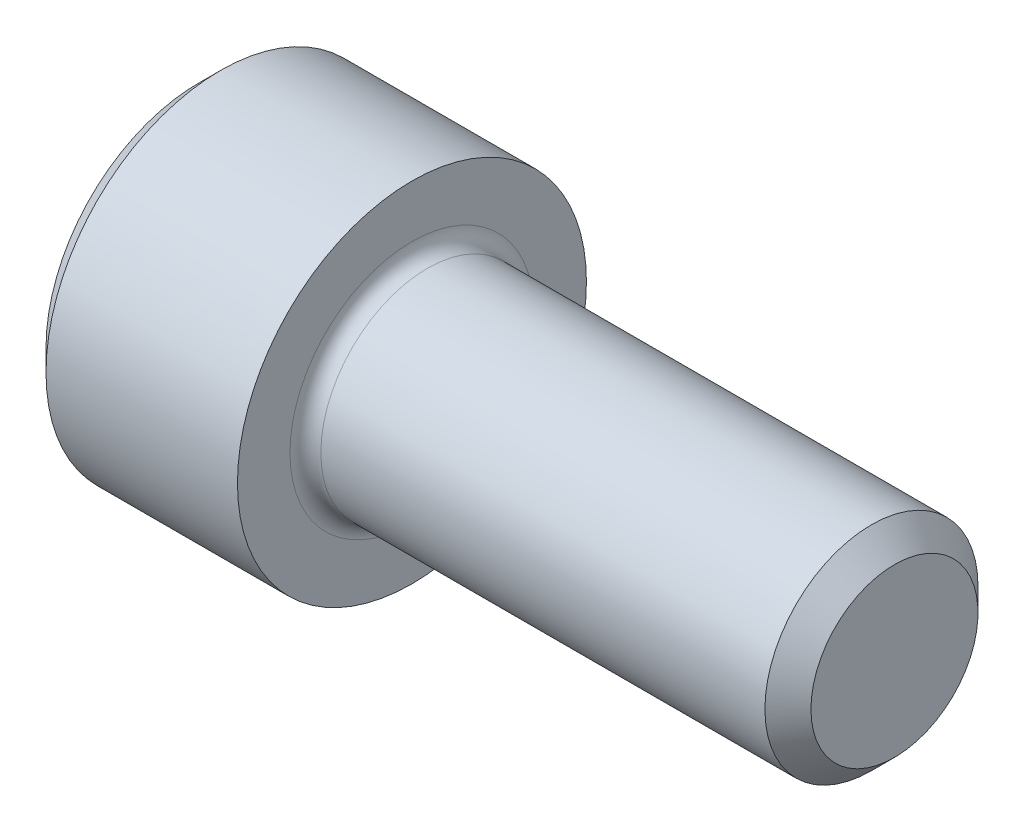
ISO-10303-21;
HEADER;
FILE_DESCRIPTION(('STEP AP214'),'2;1');
FILE_NAME('part.step','',(''),(''),'','','');
FILE_SCHEMA(('AUTOMOTIVE_DESIGN { 1 0 10303 214 1 1 1 1 }'));
ENDSEC;
DATA;
#1=APPLICATION_CONTEXT('core data for automotive mechanical design processes');
#2=APPLICATION_PROTOCOL_DEFINITION('international standard','automotive_design',2000,#1);
#3=PRODUCT_CONTEXT('',#1,'mechanical');
#4=PRODUCT('Part','Part','',(#3));
#5=PRODUCT_RELATED_PRODUCT_CATEGORY('part','',(#4));
#6=PRODUCT_DEFINITION_FORMATION('','',#4);
#7=PRODUCT_DEFINITION_CONTEXT('part definition',#1,'design');
#8=PRODUCT_DEFINITION('design','',#6,#7);
#9=PRODUCT_DEFINITION_SHAPE('','',#8);
#10=(LENGTH_UNIT() NAMED_UNIT(*) SI_UNIT(.MILLI.,.METRE.));
#11=(NAMED_UNIT(*) PLANE_ANGLE_UNIT() SI_UNIT($,.RADIAN.));
#12=(NAMED_UNIT(*) SI_UNIT($,.STERADIAN.) SOLID_ANGLE_UNIT());
#13=UNCERTAINTY_MEASURE_WITH_UNIT(LENGTH_MEASURE(1.E-05),#10,'distance_accuracy_value','');
#14=(GEOMETRIC_REPRESENTATION_CONTEXT(3) GLOBAL_UNCERTAINTY_ASSIGNED_CONTEXT((#13)) GLOBAL_UNIT_ASSIGNED_CONTEXT((#10,
#11,#12)) REPRESENTATION_CONTEXT('',''));
#15=CARTESIAN_POINT('',(0.,0.,0.));
#16=DIRECTION('',(0.,0.,1.));
#17=DIRECTION('',(1.,0.,0.));
#18=AXIS2_PLACEMENT_3D('',#15,#16,#17);
#19=CARTESIAN_POINT('',(0.,0.,0.));
#20=DIRECTION('',(-1.,0.,0.));
#21=DIRECTION('',(0.,0.,1.));
#22=AXIS2_PLACEMENT_3D('',#19,#20,#21);
#23=PLANE('',#22);
#24=DIRECTION('',(0.,-0.499999999999998,0.86602540378444));
#25=VECTOR('',#24,1.);
#26=CARTESIAN_POINT('',(0.,1.5984519552784,0.));
#27=LINE('',#26,#25);
#28=CARTESIAN_POINT('',(0.,1.5984519552784,0.));
#29=VERTEX_POINT('',#28);
#30=CARTESIAN_POINT('',(0.,0.799225977639206,1.3843));
#31=VERTEX_POINT('',#30);
#32=EDGE_CURVE('E262',#29,#31,#27,.T.);
#33=ORIENTED_EDGE('',*,*,#32,.T.);
#34=DIRECTION('',(0.,1.,0.));
#35=VECTOR('',#34,1.);
#36=CARTESIAN_POINT('',(0.,-0.799225977639191,1.3843));
#37=LINE('',#36,#35);
#38=CARTESIAN_POINT('',(0.,-0.799225977639191,1.3843));
#39=VERTEX_POINT('',#38);
#40=EDGE_CURVE('E133',#39,#31,#37,.T.);
#41=ORIENTED_EDGE('',*,*,#40,.F.);
#42=DIRECTION('',(0.,-0.500000000000001,-0.866025403784438));
#43=VECTOR('',#42,1.);
#44=CARTESIAN_POINT('',(0.,-0.799225977639191,1.3843));
#45=LINE('',#44,#43);
#46=CARTESIAN_POINT('',(0.,-1.59845195527839,0.));
#47=VERTEX_POINT('',#46);
#48=EDGE_CURVE('E265',#39,#47,#45,.T.);
#49=ORIENTED_EDGE('',*,*,#48,.T.);
#50=DIRECTION('',(0.,0.499999999999998,-0.86602540378444));
#51=VECTOR('',#50,1.);
#52=CARTESIAN_POINT('',(0.,-1.59845195527839,0.));
#53=LINE('',#52,#51);
#54=CARTESIAN_POINT('',(0.,-0.799225977639196,-1.3843));
#55=VERTEX_POINT('',#54);
#56=EDGE_CURVE('E268',#47,#55,#53,.T.);
#57=ORIENTED_EDGE('',*,*,#56,.T.);
#58=DIRECTION('',(0.,-1.,0.));
#59=VECTOR('',#58,1.);
#60=CARTESIAN_POINT('',(0.,0.799225977639201,-1.3843));
#61=LINE('',#60,#59);
#62=CARTESIAN_POINT('',(0.,0.799225977639201,-1.3843));
#63=VERTEX_POINT('',#62);
#64=EDGE_CURVE('E271',#63,#55,#61,.T.);
#65=ORIENTED_EDGE('',*,*,#64,.F.);
#66=DIRECTION('',(0.,-0.500000000000001,-0.866025403784438));
#67=VECTOR('',#66,1.);
#68=CARTESIAN_POINT('',(0.,1.5984519552784,0.));
#69=LINE('',#68,#67);
#70=EDGE_CURVE('E128',#29,#63,#69,.T.);
#71=ORIENTED_EDGE('',*,*,#70,.F.);
#72=EDGE_LOOP('',(#33,#41,#49,#57,#65,#71));
#73=FACE_BOUND('',#72,.T.);
#74=CARTESIAN_POINT('',(0.,0.,0.));
#75=DIRECTION('',(-1.,0.,0.));
#76=DIRECTION('',(0.,0.,1.));
#77=AXIS2_PLACEMENT_3D('',#74,#75,#76);
#78=CIRCLE('',#77,2.5146);
#79=CARTESIAN_POINT('',(0.,0.,2.5146));
#80=VERTEX_POINT('',#79);
#81=EDGE_CURVE('E157',#80,#80,#78,.T.);
#82=ORIENTED_EDGE('',*,*,#81,.T.);
#83=EDGE_LOOP('',(#82));
#84=FACE_BOUND('',#83,.T.);
#85=ADVANCED_FACE('F37',(#73,#84),#23,.T.);
#86=CARTESIAN_POINT('',(0.,0.,0.));
#87=DIRECTION('',(1.,0.,0.));
#88=DIRECTION('',(0.,0.,-1.));
#89=AXIS2_PLACEMENT_3D('',#86,#87,#88);
#90=CONICAL_SURFACE('',#89,2.5146,0.785398163397456);
#91=CARTESIAN_POINT('',(0.355599999999998,0.,0.));
#92=DIRECTION('',(-1.,0.,0.));
#93=DIRECTION('',(0.,0.,1.));
#94=AXIS2_PLACEMENT_3D('',#91,#92,#93);
#95=CIRCLE('',#94,2.8702);
#96=CARTESIAN_POINT('',(0.355599999999998,0.,2.8702));
#97=VERTEX_POINT('',#96);
#98=EDGE_CURVE('E154',#97,#97,#95,.T.);
#99=ORIENTED_EDGE('',*,*,#98,.T.);
#100=EDGE_LOOP('',(#99));
#101=FACE_BOUND('',#100,.T.);
#102=ORIENTED_EDGE('',*,*,#81,.F.);
#103=EDGE_LOOP('',(#102));
#104=FACE_BOUND('',#103,.T.);
#105=ADVANCED_FACE('F178',(#101,#104),#90,.T.);
#106=CARTESIAN_POINT('',(-31.75,0.,0.));
#107=DIRECTION('',(-1.,0.,0.));
#108=DIRECTION('',(0.,0.,1.));
#109=AXIS2_PLACEMENT_3D('',#106,#107,#108);
#110=CYLINDRICAL_SURFACE('',#109,2.8702);
#111=CARTESIAN_POINT('',(3.5052,0.,0.));
#112=DIRECTION('',(-1.,0.,0.));
#113=DIRECTION('',(0.,0.,1.));
#114=AXIS2_PLACEMENT_3D('',#111,#112,#113);
#115=CIRCLE('',#114,2.8702);
#116=CARTESIAN_POINT('',(3.5052,0.,2.8702));
#117=VERTEX_POINT('',#116);
#118=EDGE_CURVE('E151',#117,#117,#115,.T.);
#119=ORIENTED_EDGE('',*,*,#118,.T.);
#120=EDGE_LOOP('',(#119));
#121=FACE_BOUND('',#120,.T.);
#122=ORIENTED_EDGE('',*,*,#98,.F.);
#123=EDGE_LOOP('',(#122));
#124=FACE_BOUND('',#123,.T.);
#125=ADVANCED_FACE('F183',(#121,#124),#110,.T.);
#126=CARTESIAN_POINT('',(3.5052,2.8702,0.));
#127=DIRECTION('',(1.,0.,0.));
#128=DIRECTION('',(0.,0.,-1.));
#129=AXIS2_PLACEMENT_3D('',#126,#127,#128);
#130=PLANE('',#129);
#131=CARTESIAN_POINT('',(3.5052,0.,0.));
#132=DIRECTION('',(1.,0.,0.));
#133=DIRECTION('',(0.,0.,-1.));
#134=AXIS2_PLACEMENT_3D('',#131,#132,#133);
#135=CIRCLE('',#134,2.0066);
#136=CARTESIAN_POINT('',(3.5052,0.,-2.0066));
#137=VERTEX_POINT('',#136);
#138=EDGE_CURVE('E45',#137,#137,#135,.F.);
#139=ORIENTED_EDGE('',*,*,#138,.T.);
#140=EDGE_LOOP('',(#139));
#141=FACE_BOUND('',#140,.T.);
#142=ORIENTED_EDGE('',*,*,#118,.F.);
#143=EDGE_LOOP('',(#142));
#144=FACE_BOUND('',#143,.T.);
#145=ADVANCED_FACE('F162',(#141,#144),#130,.T.);
#146=CARTESIAN_POINT('',(-31.75,0.,0.));
#147=DIRECTION('',(-1.,0.,0.));
#148=DIRECTION('',(0.,0.,1.));
#149=AXIS2_PLACEMENT_3D('',#146,#147,#148);
#150=CYLINDRICAL_SURFACE('',#149,1.7526);
#151=CARTESIAN_POINT('',(3.7592,0.,0.));
#152=DIRECTION('',(1.,0.,0.));
#153=DIRECTION('',(0.,0.,-1.));
#154=AXIS2_PLACEMENT_3D('',#151,#152,#153);
#155=CIRCLE('',#154,1.7526);
#156=CARTESIAN_POINT('',(3.7592,0.,-1.7526));
#157=VERTEX_POINT('',#156);
#158=EDGE_CURVE('E11',#157,#157,#155,.T.);
#159=ORIENTED_EDGE('',*,*,#158,.T.);
#160=EDGE_LOOP('',(#159));
#161=FACE_BOUND('',#160,.T.);
#162=CARTESIAN_POINT('',(11.06424,0.,0.));
#163=DIRECTION('',(-1.,0.,0.));
#164=DIRECTION('',(0.,0.,1.));
#165=AXIS2_PLACEMENT_3D('',#162,#163,#164);
#166=CIRCLE('',#165,1.7526);
#167=CARTESIAN_POINT('',(11.06424,0.,1.7526));
#168=VERTEX_POINT('',#167);
#169=EDGE_CURVE('E148',#168,#168,#166,.T.);
#170=ORIENTED_EDGE('',*,*,#169,.T.);
#171=EDGE_LOOP('',(#170));
#172=FACE_BOUND('',#171,.T.);
#173=ADVANCED_FACE('F193',(#161,#172),#150,.T.);
#174=CARTESIAN_POINT('',(11.4427,0.,0.));
#175=DIRECTION('',(-1.,0.,0.));
#176=DIRECTION('',(0.,0.,1.));
#177=AXIS2_PLACEMENT_3D('',#174,#175,#176);
#178=CONICAL_SURFACE('',#177,1.37414,0.785398163397451);
#179=ORIENTED_EDGE('',*,*,#169,.F.);
#180=EDGE_LOOP('',(#179));
#181=FACE_BOUND('',#180,.T.);
#182=CARTESIAN_POINT('',(11.4427,0.,0.));
#183=DIRECTION('',(-1.,0.,0.));
#184=DIRECTION('',(0.,0.,1.));
#185=AXIS2_PLACEMENT_3D('',#182,#183,#184);
#186=CIRCLE('',#185,1.37414);
#187=CARTESIAN_POINT('',(11.4427,0.,1.37414));
#188=VERTEX_POINT('',#187);
#189=EDGE_CURVE('E144',#188,#188,#186,.T.);
#190=ORIENTED_EDGE('',*,*,#189,.T.);
#191=EDGE_LOOP('',(#190));
#192=FACE_BOUND('',#191,.T.);
#193=ADVANCED_FACE('F173',(#181,#192),#178,.T.);
#194=CARTESIAN_POINT('',(11.4427,1.37414,0.));
#195=DIRECTION('',(1.,0.,0.));
#196=DIRECTION('',(0.,0.,-1.));
#197=AXIS2_PLACEMENT_3D('',#194,#195,#196);
#198=PLANE('',#197);
#199=ORIENTED_EDGE('',*,*,#189,.F.);
#200=EDGE_LOOP('',(#199));
#201=FACE_BOUND('',#200,.T.);
#202=ADVANCED_FACE('F166',(#201),#198,.T.);
#203=CARTESIAN_POINT('',(3.7592,0.,0.));
#204=DIRECTION('',(1.,0.,0.));
#205=DIRECTION('',(0.,0.,-1.));
#206=AXIS2_PLACEMENT_3D('',#203,#204,#205);
#207=TOROIDAL_SURFACE('',#206,2.0066,0.254);
#208=ORIENTED_EDGE('',*,*,#158,.F.);
#209=EDGE_LOOP('',(#208));
#210=FACE_BOUND('',#209,.T.);
#211=ORIENTED_EDGE('',*,*,#138,.F.);
#212=EDGE_LOOP('',(#211));
#213=FACE_BOUND('',#212,.T.);
#214=ADVANCED_FACE('F39',(#210,#213),#207,.F.);
#215=CARTESIAN_POINT('',(1.6256,1.5984519552784,0.));
#216=DIRECTION('',(0.,-0.86602540378444,-0.499999999999998));
#217=DIRECTION('',(0.,0.499999999999998,-0.86602540378444));
#218=AXIS2_PLACEMENT_3D('',#215,#216,#217);
#219=PLANE('',#218);
#220=ORIENTED_EDGE('',*,*,#32,.F.);
#221=DIRECTION('',(-1.,0.,0.));
#222=VECTOR('',#221,1.);
#223=CARTESIAN_POINT('',(1.6256,1.5984519552784,0.));
#224=LINE('',#223,#222);
#225=CARTESIAN_POINT('',(1.6256,1.5984519552784,0.));
#226=VERTEX_POINT('',#225);
#227=EDGE_CURVE('E252',#226,#29,#224,.T.);
#228=ORIENTED_EDGE('',*,*,#227,.F.);
#229=DIRECTION('',(0.,-0.499999999999998,0.86602540378444));
#230=VECTOR('',#229,1.);
#231=CARTESIAN_POINT('',(1.6256,1.5984519552784,0.));
#232=LINE('',#231,#230);
#233=CARTESIAN_POINT('',(1.6256,1.1988389664588,0.692149999999999));
#234=VERTEX_POINT('',#233);
#235=EDGE_CURVE('E120',#226,#234,#232,.T.);
#236=ORIENTED_EDGE('',*,*,#235,.T.);
#237=CARTESIAN_POINT('',(1.6256,0.799225977639206,1.3843));
#238=VERTEX_POINT('',#237);
#239=EDGE_CURVE('E111',#234,#238,#232,.T.);
#240=ORIENTED_EDGE('',*,*,#239,.T.);
#241=DIRECTION('',(-1.,0.,0.));
#242=VECTOR('',#241,1.);
#243=CARTESIAN_POINT('',(1.6256,0.799225977639206,1.3843));
#244=LINE('',#243,#242);
#245=EDGE_CURVE('E125',#238,#31,#244,.T.);
#246=ORIENTED_EDGE('',*,*,#245,.T.);
#247=EDGE_LOOP('',(#220,#228,#236,#240,#246));
#248=FACE_BOUND('',#247,.T.);
#249=ADVANCED_FACE('F124',(#248),#219,.T.);
#250=CARTESIAN_POINT('',(1.6256,-0.799225977639191,1.3843));
#251=DIRECTION('',(0.,0.,1.));
#252=DIRECTION('',(0.,-1.,0.));
#253=AXIS2_PLACEMENT_3D('',#250,#251,#252);
#254=PLANE('',#253);
#255=ORIENTED_EDGE('',*,*,#40,.T.);
#256=ORIENTED_EDGE('',*,*,#245,.F.);
#257=DIRECTION('',(0.,1.,0.));
#258=VECTOR('',#257,1.);
#259=CARTESIAN_POINT('',(1.6256,-0.799225977639191,1.3843));
#260=LINE('',#259,#258);
#261=CARTESIAN_POINT('',(1.6256,0.,1.3843));
#262=VERTEX_POINT('',#261);
#263=EDGE_CURVE('E108',#262,#238,#260,.T.);
#264=ORIENTED_EDGE('',*,*,#263,.F.);
#265=CARTESIAN_POINT('',(1.6256,-0.799225977639191,1.3843));
#266=VERTEX_POINT('',#265);
#267=EDGE_CURVE('E119',#266,#262,#260,.T.);
#268=ORIENTED_EDGE('',*,*,#267,.F.);
#269=DIRECTION('',(-1.,0.,0.));
#270=VECTOR('',#269,1.);
#271=CARTESIAN_POINT('',(1.6256,-0.799225977639191,1.3843));
#272=LINE('',#271,#270);
#273=EDGE_CURVE('E135',#266,#39,#272,.T.);
#274=ORIENTED_EDGE('',*,*,#273,.T.);
#275=EDGE_LOOP('',(#255,#256,#264,#268,#274));
#276=FACE_BOUND('',#275,.T.);
#277=ADVANCED_FACE('F130',(#276),#254,.F.);
#278=CARTESIAN_POINT('',(1.6256,-0.799225977639191,1.3843));
#279=DIRECTION('',(0.,0.866025403784438,-0.500000000000001));
#280=DIRECTION('',(0.,0.500000000000001,0.866025403784438));
#281=AXIS2_PLACEMENT_3D('',#278,#279,#280);
#282=PLANE('',#281);
#283=ORIENTED_EDGE('',*,*,#48,.F.);
#284=ORIENTED_EDGE('',*,*,#273,.F.);
#285=DIRECTION('',(0.,-0.500000000000001,-0.866025403784438));
#286=VECTOR('',#285,1.);
#287=CARTESIAN_POINT('',(1.6256,-0.799225977639191,1.3843));
#288=LINE('',#287,#286);
#289=CARTESIAN_POINT('',(1.6256,-1.19883896645879,0.692149999999998));
#290=VERTEX_POINT('',#289);
#291=EDGE_CURVE('E291',#266,#290,#288,.T.);
#292=ORIENTED_EDGE('',*,*,#291,.T.);
#293=CARTESIAN_POINT('',(1.6256,-1.59845195527839,0.));
#294=VERTEX_POINT('',#293);
#295=EDGE_CURVE('E280',#290,#294,#288,.T.);
#296=ORIENTED_EDGE('',*,*,#295,.T.);
#297=DIRECTION('',(-1.,0.,0.));
#298=VECTOR('',#297,1.);
#299=CARTESIAN_POINT('',(1.6256,-1.59845195527839,0.));
#300=LINE('',#299,#298);
#301=EDGE_CURVE('E140',#294,#47,#300,.T.);
#302=ORIENTED_EDGE('',*,*,#301,.T.);
#303=EDGE_LOOP('',(#283,#284,#292,#296,#302));
#304=FACE_BOUND('',#303,.T.);
#305=ADVANCED_FACE('F206',(#304),#282,.T.);
#306=CARTESIAN_POINT('',(1.6256,-1.59845195527839,0.));
#307=DIRECTION('',(0.,0.86602540378444,0.499999999999998));
#308=DIRECTION('',(0.,-0.499999999999998,0.86602540378444));
#309=AXIS2_PLACEMENT_3D('',#306,#307,#308);
#310=PLANE('',#309);
#311=ORIENTED_EDGE('',*,*,#56,.F.);
#312=ORIENTED_EDGE('',*,*,#301,.F.);
#313=DIRECTION('',(0.,0.499999999999998,-0.86602540378444));
#314=VECTOR('',#313,1.);
#315=CARTESIAN_POINT('',(1.6256,-1.59845195527839,0.));
#316=LINE('',#315,#314);
#317=CARTESIAN_POINT('',(1.6256,-1.1988389664588,-0.692149999999995));
#318=VERTEX_POINT('',#317);
#319=EDGE_CURVE('E258',#294,#318,#316,.T.);
#320=ORIENTED_EDGE('',*,*,#319,.T.);
#321=CARTESIAN_POINT('',(1.6256,-0.799225977639196,-1.3843));
#322=VERTEX_POINT('',#321);
#323=EDGE_CURVE('E290',#318,#322,#316,.T.);
#324=ORIENTED_EDGE('',*,*,#323,.T.);
#325=DIRECTION('',(-1.,0.,0.));
#326=VECTOR('',#325,1.);
#327=CARTESIAN_POINT('',(1.6256,-0.799225977639196,-1.3843));
#328=LINE('',#327,#326);
#329=EDGE_CURVE('E251',#322,#55,#328,.T.);
#330=ORIENTED_EDGE('',*,*,#329,.T.);
#331=EDGE_LOOP('',(#311,#312,#320,#324,#330));
#332=FACE_BOUND('',#331,.T.);
#333=ADVANCED_FACE('F209',(#332),#310,.T.);
#334=CARTESIAN_POINT('',(1.6256,0.799225977639201,-1.3843));
#335=DIRECTION('',(0.,0.,-1.));
#336=DIRECTION('',(0.,1.,0.));
#337=AXIS2_PLACEMENT_3D('',#334,#335,#336);
#338=PLANE('',#337);
#339=ORIENTED_EDGE('',*,*,#64,.T.);
#340=ORIENTED_EDGE('',*,*,#329,.F.);
#341=DIRECTION('',(0.,-1.,0.));
#342=VECTOR('',#341,1.);
#343=CARTESIAN_POINT('',(1.6256,0.799225977639201,-1.3843));
#344=LINE('',#343,#342);
#345=CARTESIAN_POINT('',(1.6256,0.,-1.3843));
#346=VERTEX_POINT('',#345);
#347=EDGE_CURVE('E255',#346,#322,#344,.T.);
#348=ORIENTED_EDGE('',*,*,#347,.F.);
#349=CARTESIAN_POINT('',(1.6256,0.799225977639201,-1.3843));
#350=VERTEX_POINT('',#349);
#351=EDGE_CURVE('E52',#350,#346,#344,.T.);
#352=ORIENTED_EDGE('',*,*,#351,.F.);
#353=DIRECTION('',(-1.,0.,0.));
#354=VECTOR('',#353,1.);
#355=CARTESIAN_POINT('',(1.6256,0.799225977639201,-1.3843));
#356=LINE('',#355,#354);
#357=EDGE_CURVE('E248',#350,#63,#356,.T.);
#358=ORIENTED_EDGE('',*,*,#357,.T.);
#359=EDGE_LOOP('',(#339,#340,#348,#352,#358));
#360=FACE_BOUND('',#359,.T.);
#361=ADVANCED_FACE('F213',(#360),#338,.F.);
#362=CARTESIAN_POINT('',(1.6256,1.5984519552784,0.));
#363=DIRECTION('',(0.,0.866025403784438,-0.500000000000001));
#364=DIRECTION('',(0.,0.500000000000001,0.866025403784438));
#365=AXIS2_PLACEMENT_3D('',#362,#363,#364);
#366=PLANE('',#365);
#367=ORIENTED_EDGE('',*,*,#70,.T.);
#368=ORIENTED_EDGE('',*,*,#357,.F.);
#369=DIRECTION('',(0.,-0.500000000000001,-0.866025403784438));
#370=VECTOR('',#369,1.);
#371=CARTESIAN_POINT('',(1.6256,1.5984519552784,0.));
#372=LINE('',#371,#370);
#373=CARTESIAN_POINT('',(1.6256,1.1988389664588,-0.692150000000004));
#374=VERTEX_POINT('',#373);
#375=EDGE_CURVE('E238',#374,#350,#372,.T.);
#376=ORIENTED_EDGE('',*,*,#375,.F.);
#377=EDGE_CURVE('E244',#226,#374,#372,.T.);
#378=ORIENTED_EDGE('',*,*,#377,.F.);
#379=ORIENTED_EDGE('',*,*,#227,.T.);
#380=EDGE_LOOP('',(#367,#368,#376,#378,#379));
#381=FACE_BOUND('',#380,.T.);
#382=ADVANCED_FACE('F217',(#381),#366,.F.);
#383=CARTESIAN_POINT('',(1.6256,2.3976779329176,-1.3843));
#384=DIRECTION('',(1.,0.,0.));
#385=DIRECTION('',(0.,0.,-1.));
#386=AXIS2_PLACEMENT_3D('',#383,#384,#385);
#387=PLANE('',#386);
#388=ORIENTED_EDGE('',*,*,#347,.T.);
#389=ORIENTED_EDGE('',*,*,#323,.F.);
#390=CARTESIAN_POINT('',(1.6256,0.,0.));
#391=DIRECTION('',(-1.,0.,0.));
#392=DIRECTION('',(0.,0.,1.));
#393=AXIS2_PLACEMENT_3D('',#390,#391,#392);
#394=CIRCLE('',#393,1.3843);
#395=EDGE_CURVE('E286',#346,#318,#394,.T.);
#396=ORIENTED_EDGE('',*,*,#395,.F.);
#397=EDGE_LOOP('',(#388,#389,#396));
#398=FACE_BOUND('',#397,.T.);
#399=ADVANCED_FACE('F221',(#398),#387,.F.);
#400=ORIENTED_EDGE('',*,*,#319,.F.);
#401=ORIENTED_EDGE('',*,*,#295,.F.);
#402=EDGE_CURVE('E138',#318,#290,#394,.T.);
#403=ORIENTED_EDGE('',*,*,#402,.F.);
#404=EDGE_LOOP('',(#400,#401,#403));
#405=FACE_BOUND('',#404,.T.);
#406=ADVANCED_FACE('F224',(#405),#387,.F.);
#407=ORIENTED_EDGE('',*,*,#291,.F.);
#408=ORIENTED_EDGE('',*,*,#267,.T.);
#409=EDGE_CURVE('E134',#290,#262,#394,.T.);
#410=ORIENTED_EDGE('',*,*,#409,.F.);
#411=EDGE_LOOP('',(#407,#408,#410));
#412=FACE_BOUND('',#411,.T.);
#413=ADVANCED_FACE('F229',(#412),#387,.F.);
#414=ORIENTED_EDGE('',*,*,#263,.T.);
#415=ORIENTED_EDGE('',*,*,#239,.F.);
#416=EDGE_CURVE('E114',#262,#234,#394,.T.);
#417=ORIENTED_EDGE('',*,*,#416,.F.);
#418=EDGE_LOOP('',(#414,#415,#417));
#419=FACE_BOUND('',#418,.T.);
#420=ADVANCED_FACE('F110',(#419),#387,.F.);
#421=ORIENTED_EDGE('',*,*,#235,.F.);
#422=ORIENTED_EDGE('',*,*,#377,.T.);
#423=EDGE_CURVE('E145',#234,#374,#394,.T.);
#424=ORIENTED_EDGE('',*,*,#423,.F.);
#425=EDGE_LOOP('',(#421,#422,#424));
#426=FACE_BOUND('',#425,.T.);
#427=ADVANCED_FACE('F232',(#426),#387,.F.);
#428=ORIENTED_EDGE('',*,*,#375,.T.);
#429=ORIENTED_EDGE('',*,*,#351,.T.);
#430=EDGE_CURVE('E241',#374,#346,#394,.T.);
#431=ORIENTED_EDGE('',*,*,#430,.F.);
#432=EDGE_LOOP('',(#428,#429,#431));
#433=FACE_BOUND('',#432,.T.);
#434=ADVANCED_FACE('F202',(#433),#387,.F.);
#435=CARTESIAN_POINT('',(1.6256,0.,0.));
#436=DIRECTION('',(-1.,0.,0.));
#437=DIRECTION('',(0.,0.,1.));
#438=AXIS2_PLACEMENT_3D('',#435,#436,#437);
#439=CONICAL_SURFACE('',#438,1.3843,1.04719755119659);
#440=CARTESIAN_POINT('',(2.4248259776392,0.,0.));
#441=VERTEX_POINT('',#440);
#442=VERTEX_LOOP('',#441);
#443=FACE_BOUND('',#442,.T.);
#444=ORIENTED_EDGE('',*,*,#416,.T.);
#445=ORIENTED_EDGE('',*,*,#423,.T.);
#446=ORIENTED_EDGE('',*,*,#430,.T.);
#447=ORIENTED_EDGE('',*,*,#395,.T.);
#448=ORIENTED_EDGE('',*,*,#402,.T.);
#449=ORIENTED_EDGE('',*,*,#409,.T.);
#450=EDGE_LOOP('',(#444,#445,#446,#447,#448,#449));
#451=FACE_BOUND('',#450,.T.);
#452=ADVANCED_FACE('F200',(#443,#451),#439,.F.);
#453=CLOSED_SHELL('',(#85,#105,#125,#145,#173,#193,#202,#214,#249,#277,#305,#333,#361,#382,#399,
#406,#413,#420,#427,#434,#452));
#454=MANIFOLD_SOLID_BREP('B2',#453);
#455=ADVANCED_BREP_SHAPE_REPRESENTATION('',(#18,#454),#14);
#456=SHAPE_DEFINITION_REPRESENTATION(#9,#455);
ENDSEC;
END-ISO-10303-21;
